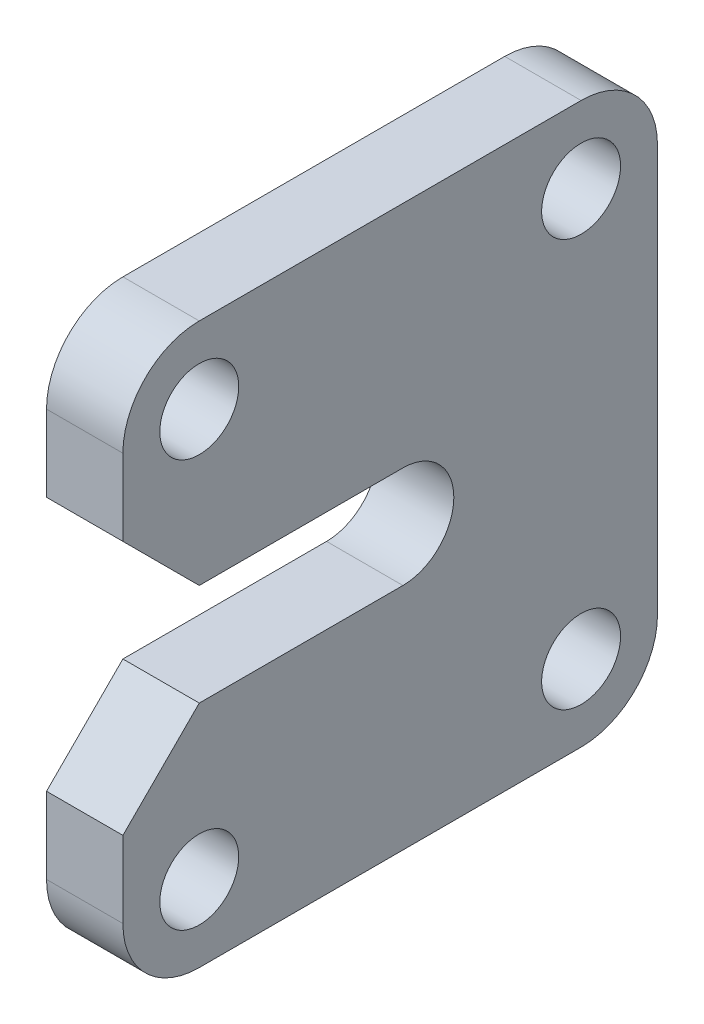
ISO-10303-21;
HEADER;
FILE_DESCRIPTION(('STEP AP214'),'2;1');
FILE_NAME('part.step','',(''),(''),'','','');
FILE_SCHEMA(('AUTOMOTIVE_DESIGN { 1 0 10303 214 1 1 1 1 }'));
ENDSEC;
DATA;
#1=APPLICATION_CONTEXT('core data for automotive mechanical design processes');
#2=APPLICATION_PROTOCOL_DEFINITION('international standard','automotive_design',2000,#1);
#3=PRODUCT_CONTEXT('',#1,'mechanical');
#4=PRODUCT('Part','Part','',(#3));
#5=PRODUCT_RELATED_PRODUCT_CATEGORY('part','',(#4));
#6=PRODUCT_DEFINITION_FORMATION('','',#4);
#7=PRODUCT_DEFINITION_CONTEXT('part definition',#1,'design');
#8=PRODUCT_DEFINITION('design','',#6,#7);
#9=PRODUCT_DEFINITION_SHAPE('','',#8);
#10=(LENGTH_UNIT() NAMED_UNIT(*) SI_UNIT(.MILLI.,.METRE.));
#11=(NAMED_UNIT(*) PLANE_ANGLE_UNIT() SI_UNIT($,.RADIAN.));
#12=(NAMED_UNIT(*) SI_UNIT($,.STERADIAN.) SOLID_ANGLE_UNIT());
#13=UNCERTAINTY_MEASURE_WITH_UNIT(LENGTH_MEASURE(1.E-05),#10,'distance_accuracy_value','');
#14=(GEOMETRIC_REPRESENTATION_CONTEXT(3) GLOBAL_UNCERTAINTY_ASSIGNED_CONTEXT((#13)) GLOBAL_UNIT_ASSIGNED_CONTEXT((#10,
#11,#12)) REPRESENTATION_CONTEXT('',''));
#15=CARTESIAN_POINT('',(0.,0.,0.));
#16=DIRECTION('',(0.,0.,1.));
#17=DIRECTION('',(1.,0.,0.));
#18=AXIS2_PLACEMENT_3D('',#15,#16,#17);
#19=CARTESIAN_POINT('',(1.5,0.,99.));
#20=DIRECTION('',(-1.,0.,0.));
#21=DIRECTION('',(0.,0.,1.));
#22=AXIS2_PLACEMENT_3D('',#19,#20,#21);
#23=PLANE('',#22);
#24=DIRECTION('',(0.,-1.,0.));
#25=VECTOR('',#24,1.);
#26=CARTESIAN_POINT('',(1.5,-5.,110.));
#27=LINE('',#26,#25);
#28=CARTESIAN_POINT('',(1.5,-5.,110.));
#29=VERTEX_POINT('',#28);
#30=CARTESIAN_POINT('',(1.5,-7.99999999999999,110.));
#31=VERTEX_POINT('',#30);
#32=EDGE_CURVE('E263',#29,#31,#27,.T.);
#33=ORIENTED_EDGE('',*,*,#32,.T.);
#34=CARTESIAN_POINT('',(1.5,-8.,107.));
#35=DIRECTION('',(-1.,0.,0.));
#36=DIRECTION('',(0.,0.,1.));
#37=AXIS2_PLACEMENT_3D('',#34,#35,#36);
#38=CIRCLE('',#37,3.);
#39=CARTESIAN_POINT('',(1.5,-11.,107.));
#40=VERTEX_POINT('',#39);
#41=EDGE_CURVE('E184',#31,#40,#38,.F.);
#42=ORIENTED_EDGE('',*,*,#41,.T.);
#43=DIRECTION('',(0.,0.,-1.));
#44=VECTOR('',#43,1.);
#45=CARTESIAN_POINT('',(1.5,-11.,89.));
#46=LINE('',#45,#44);
#47=CARTESIAN_POINT('',(1.5,-11.,92.));
#48=VERTEX_POINT('',#47);
#49=EDGE_CURVE('E257',#40,#48,#46,.T.);
#50=ORIENTED_EDGE('',*,*,#49,.T.);
#51=CARTESIAN_POINT('',(1.5,-8.,92.));
#52=DIRECTION('',(-1.,0.,0.));
#53=DIRECTION('',(0.,0.,1.));
#54=AXIS2_PLACEMENT_3D('',#51,#52,#53);
#55=CIRCLE('',#54,3.);
#56=CARTESIAN_POINT('',(1.5,-8.,89.));
#57=VERTEX_POINT('',#56);
#58=EDGE_CURVE('E182',#48,#57,#55,.F.);
#59=ORIENTED_EDGE('',*,*,#58,.T.);
#60=DIRECTION('',(0.,1.,0.));
#61=VECTOR('',#60,1.);
#62=CARTESIAN_POINT('',(1.5,11.,89.));
#63=LINE('',#62,#61);
#64=CARTESIAN_POINT('',(1.5,8.,89.));
#65=VERTEX_POINT('',#64);
#66=EDGE_CURVE('E256',#57,#65,#63,.T.);
#67=ORIENTED_EDGE('',*,*,#66,.T.);
#68=CARTESIAN_POINT('',(1.5,8.,92.));
#69=DIRECTION('',(-1.,0.,0.));
#70=DIRECTION('',(0.,0.,1.));
#71=AXIS2_PLACEMENT_3D('',#68,#69,#70);
#72=CIRCLE('',#71,3.);
#73=CARTESIAN_POINT('',(1.5,11.,92.));
#74=VERTEX_POINT('',#73);
#75=EDGE_CURVE('E180',#65,#74,#72,.F.);
#76=ORIENTED_EDGE('',*,*,#75,.T.);
#77=DIRECTION('',(0.,0.,1.));
#78=VECTOR('',#77,1.);
#79=CARTESIAN_POINT('',(1.5,11.,89.));
#80=LINE('',#79,#78);
#81=CARTESIAN_POINT('',(1.5,11.,107.));
#82=VERTEX_POINT('',#81);
#83=EDGE_CURVE('E196',#74,#82,#80,.T.);
#84=ORIENTED_EDGE('',*,*,#83,.T.);
#85=CARTESIAN_POINT('',(1.5,8.,107.));
#86=DIRECTION('',(-1.,0.,0.));
#87=DIRECTION('',(0.,0.,1.));
#88=AXIS2_PLACEMENT_3D('',#85,#86,#87);
#89=CIRCLE('',#88,3.);
#90=CARTESIAN_POINT('',(1.5,8.,110.));
#91=VERTEX_POINT('',#90);
#92=EDGE_CURVE('E47',#82,#91,#89,.F.);
#93=ORIENTED_EDGE('',*,*,#92,.T.);
#94=DIRECTION('',(0.,-1.,0.));
#95=VECTOR('',#94,1.);
#96=CARTESIAN_POINT('',(1.5,11.,110.));
#97=LINE('',#96,#95);
#98=CARTESIAN_POINT('',(1.5,4.99999999999999,110.));
#99=VERTEX_POINT('',#98);
#100=EDGE_CURVE('E150',#91,#99,#97,.T.);
#101=ORIENTED_EDGE('',*,*,#100,.T.);
#102=DIRECTION('',(0.,-0.707106781186546,-0.707106781186549));
#103=VECTOR('',#102,1.);
#104=CARTESIAN_POINT('',(1.5,4.99999999999999,110.));
#105=LINE('',#104,#103);
#106=CARTESIAN_POINT('',(1.5,2.,107.));
#107=VERTEX_POINT('',#106);
#108=EDGE_CURVE('E145',#99,#107,#105,.T.);
#109=ORIENTED_EDGE('',*,*,#108,.T.);
#110=DIRECTION('',(0.,0.,-1.));
#111=VECTOR('',#110,1.);
#112=CARTESIAN_POINT('',(1.5,2.,107.));
#113=LINE('',#112,#111);
#114=CARTESIAN_POINT('',(1.5,2.,99.));
#115=VERTEX_POINT('',#114);
#116=EDGE_CURVE('E135',#107,#115,#113,.T.);
#117=ORIENTED_EDGE('',*,*,#116,.T.);
#118=CARTESIAN_POINT('',(1.5,0.,99.));
#119=DIRECTION('',(-1.,0.,0.));
#120=DIRECTION('',(0.,0.,1.));
#121=AXIS2_PLACEMENT_3D('',#118,#119,#120);
#122=CIRCLE('',#121,2.);
#123=CARTESIAN_POINT('',(1.5,-2.,99.));
#124=VERTEX_POINT('',#123);
#125=EDGE_CURVE('E144',#115,#124,#122,.T.);
#126=ORIENTED_EDGE('',*,*,#125,.T.);
#127=DIRECTION('',(0.,0.,1.));
#128=VECTOR('',#127,1.);
#129=CARTESIAN_POINT('',(1.5,-2.,99.));
#130=LINE('',#129,#128);
#131=CARTESIAN_POINT('',(1.5,-2.,107.));
#132=VERTEX_POINT('',#131);
#133=EDGE_CURVE('E228',#124,#132,#130,.T.);
#134=ORIENTED_EDGE('',*,*,#133,.T.);
#135=DIRECTION('',(0.,-0.707106781186549,0.707106781186546));
#136=VECTOR('',#135,1.);
#137=CARTESIAN_POINT('',(1.5,-2.,107.));
#138=LINE('',#137,#136);
#139=EDGE_CURVE('E271',#132,#29,#138,.T.);
#140=ORIENTED_EDGE('',*,*,#139,.T.);
#141=EDGE_LOOP('',(#33,#42,#50,#59,#67,#76,#84,#93,#101,#109,#117,#126,#134,#140));
#142=FACE_BOUND('',#141,.T.);
#143=CARTESIAN_POINT('',(1.5,8.,107.));
#144=DIRECTION('',(1.,0.,0.));
#145=DIRECTION('',(0.,0.,-1.));
#146=AXIS2_PLACEMENT_3D('',#143,#144,#145);
#147=CIRCLE('',#146,1.54999999999999);
#148=CARTESIAN_POINT('',(1.5,8.,105.45));
#149=VERTEX_POINT('',#148);
#150=EDGE_CURVE('E268',#149,#149,#147,.T.);
#151=ORIENTED_EDGE('',*,*,#150,.F.);
#152=EDGE_LOOP('',(#151));
#153=FACE_BOUND('',#152,.T.);
#154=CARTESIAN_POINT('',(1.5,8.,92.));
#155=DIRECTION('',(1.,0.,0.));
#156=DIRECTION('',(0.,0.,-1.));
#157=AXIS2_PLACEMENT_3D('',#154,#155,#156);
#158=CIRCLE('',#157,1.55000000000001);
#159=CARTESIAN_POINT('',(1.5,8.,90.45));
#160=VERTEX_POINT('',#159);
#161=EDGE_CURVE('E475',#160,#160,#158,.T.);
#162=ORIENTED_EDGE('',*,*,#161,.F.);
#163=EDGE_LOOP('',(#162));
#164=FACE_BOUND('',#163,.T.);
#165=CARTESIAN_POINT('',(1.5,-8.,92.));
#166=DIRECTION('',(1.,0.,0.));
#167=DIRECTION('',(0.,0.,-1.));
#168=AXIS2_PLACEMENT_3D('',#165,#166,#167);
#169=CIRCLE('',#168,1.55000000000001);
#170=CARTESIAN_POINT('',(1.5,-8.,90.45));
#171=VERTEX_POINT('',#170);
#172=EDGE_CURVE('E469',#171,#171,#169,.T.);
#173=ORIENTED_EDGE('',*,*,#172,.F.);
#174=EDGE_LOOP('',(#173));
#175=FACE_BOUND('',#174,.T.);
#176=CARTESIAN_POINT('',(1.5,-8.,107.));
#177=DIRECTION('',(1.,0.,0.));
#178=DIRECTION('',(0.,0.,-1.));
#179=AXIS2_PLACEMENT_3D('',#176,#177,#178);
#180=CIRCLE('',#179,1.54999999999999);
#181=CARTESIAN_POINT('',(1.5,-8.,105.45));
#182=VERTEX_POINT('',#181);
#183=EDGE_CURVE('E460',#182,#182,#180,.T.);
#184=ORIENTED_EDGE('',*,*,#183,.F.);
#185=EDGE_LOOP('',(#184));
#186=FACE_BOUND('',#185,.T.);
#187=ADVANCED_FACE('F32',(#142,#153,#164,#175,#186),#23,.F.);
#188=CARTESIAN_POINT('',(-1.5,0.,99.));
#189=DIRECTION('',(-1.,0.,0.));
#190=DIRECTION('',(0.,0.,1.));
#191=AXIS2_PLACEMENT_3D('',#188,#189,#190);
#192=PLANE('',#191);
#193=CARTESIAN_POINT('',(-1.5,-8.,92.));
#194=DIRECTION('',(1.,0.,0.));
#195=DIRECTION('',(0.,0.,-1.));
#196=AXIS2_PLACEMENT_3D('',#193,#194,#195);
#197=CIRCLE('',#196,1.55000000000001);
#198=CARTESIAN_POINT('',(-1.5,-8.,90.45));
#199=VERTEX_POINT('',#198);
#200=EDGE_CURVE('E466',#199,#199,#197,.T.);
#201=ORIENTED_EDGE('',*,*,#200,.T.);
#202=EDGE_LOOP('',(#201));
#203=FACE_BOUND('',#202,.T.);
#204=CARTESIAN_POINT('',(-1.5,8.,107.));
#205=DIRECTION('',(1.,0.,0.));
#206=DIRECTION('',(0.,0.,-1.));
#207=AXIS2_PLACEMENT_3D('',#204,#205,#206);
#208=CIRCLE('',#207,1.54999999999999);
#209=CARTESIAN_POINT('',(-1.5,8.,105.45));
#210=VERTEX_POINT('',#209);
#211=EDGE_CURVE('E478',#210,#210,#208,.T.);
#212=ORIENTED_EDGE('',*,*,#211,.T.);
#213=EDGE_LOOP('',(#212));
#214=FACE_BOUND('',#213,.T.);
#215=DIRECTION('',(0.,0.,-1.));
#216=VECTOR('',#215,1.);
#217=CARTESIAN_POINT('',(-1.5,-11.,89.));
#218=LINE('',#217,#216);
#219=CARTESIAN_POINT('',(-1.5,-11.,107.));
#220=VERTEX_POINT('',#219);
#221=CARTESIAN_POINT('',(-1.5,-11.,92.));
#222=VERTEX_POINT('',#221);
#223=EDGE_CURVE('E209',#220,#222,#218,.T.);
#224=ORIENTED_EDGE('',*,*,#223,.F.);
#225=CARTESIAN_POINT('',(-1.5,-8.,107.));
#226=DIRECTION('',(-1.,0.,0.));
#227=DIRECTION('',(0.,0.,1.));
#228=AXIS2_PLACEMENT_3D('',#225,#226,#227);
#229=CIRCLE('',#228,3.);
#230=CARTESIAN_POINT('',(-1.5,-7.99999999999999,110.));
#231=VERTEX_POINT('',#230);
#232=EDGE_CURVE('E175',#220,#231,#229,.T.);
#233=ORIENTED_EDGE('',*,*,#232,.T.);
#234=DIRECTION('',(0.,-1.,0.));
#235=VECTOR('',#234,1.);
#236=CARTESIAN_POINT('',(-1.5,-5.,110.));
#237=LINE('',#236,#235);
#238=CARTESIAN_POINT('',(-1.5,-5.,110.));
#239=VERTEX_POINT('',#238);
#240=EDGE_CURVE('E236',#239,#231,#237,.T.);
#241=ORIENTED_EDGE('',*,*,#240,.F.);
#242=DIRECTION('',(0.,-0.707106781186549,0.707106781186546));
#243=VECTOR('',#242,1.);
#244=CARTESIAN_POINT('',(-1.5,-2.,107.));
#245=LINE('',#244,#243);
#246=CARTESIAN_POINT('',(-1.5,-2.,107.));
#247=VERTEX_POINT('',#246);
#248=EDGE_CURVE('E234',#247,#239,#245,.T.);
#249=ORIENTED_EDGE('',*,*,#248,.F.);
#250=DIRECTION('',(0.,0.,1.));
#251=VECTOR('',#250,1.);
#252=CARTESIAN_POINT('',(-1.5,-2.,99.));
#253=LINE('',#252,#251);
#254=CARTESIAN_POINT('',(-1.5,-2.,99.));
#255=VERTEX_POINT('',#254);
#256=EDGE_CURVE('E227',#255,#247,#253,.T.);
#257=ORIENTED_EDGE('',*,*,#256,.F.);
#258=CARTESIAN_POINT('',(-1.5,0.,99.));
#259=DIRECTION('',(-1.,0.,0.));
#260=DIRECTION('',(0.,0.,1.));
#261=AXIS2_PLACEMENT_3D('',#258,#259,#260);
#262=CIRCLE('',#261,2.);
#263=CARTESIAN_POINT('',(-1.5,2.,99.));
#264=VERTEX_POINT('',#263);
#265=EDGE_CURVE('E232',#264,#255,#262,.T.);
#266=ORIENTED_EDGE('',*,*,#265,.F.);
#267=DIRECTION('',(0.,0.,-1.));
#268=VECTOR('',#267,1.);
#269=CARTESIAN_POINT('',(-1.5,2.,107.));
#270=LINE('',#269,#268);
#271=CARTESIAN_POINT('',(-1.5,2.,107.));
#272=VERTEX_POINT('',#271);
#273=EDGE_CURVE('E238',#272,#264,#270,.T.);
#274=ORIENTED_EDGE('',*,*,#273,.F.);
#275=DIRECTION('',(0.,-0.707106781186546,-0.707106781186549));
#276=VECTOR('',#275,1.);
#277=CARTESIAN_POINT('',(-1.5,4.99999999999999,110.));
#278=LINE('',#277,#276);
#279=CARTESIAN_POINT('',(-1.5,4.99999999999999,110.));
#280=VERTEX_POINT('',#279);
#281=EDGE_CURVE('E158',#280,#272,#278,.T.);
#282=ORIENTED_EDGE('',*,*,#281,.F.);
#283=DIRECTION('',(0.,-1.,0.));
#284=VECTOR('',#283,1.);
#285=CARTESIAN_POINT('',(-1.5,11.,110.));
#286=LINE('',#285,#284);
#287=CARTESIAN_POINT('',(-1.5,8.,110.));
#288=VERTEX_POINT('',#287);
#289=EDGE_CURVE('E154',#288,#280,#286,.T.);
#290=ORIENTED_EDGE('',*,*,#289,.F.);
#291=CARTESIAN_POINT('',(-1.5,8.,107.));
#292=DIRECTION('',(-1.,0.,0.));
#293=DIRECTION('',(0.,0.,1.));
#294=AXIS2_PLACEMENT_3D('',#291,#292,#293);
#295=CIRCLE('',#294,3.);
#296=CARTESIAN_POINT('',(-1.5,11.,107.));
#297=VERTEX_POINT('',#296);
#298=EDGE_CURVE('E169',#288,#297,#295,.T.);
#299=ORIENTED_EDGE('',*,*,#298,.T.);
#300=DIRECTION('',(0.,0.,1.));
#301=VECTOR('',#300,1.);
#302=CARTESIAN_POINT('',(-1.5,11.,89.));
#303=LINE('',#302,#301);
#304=CARTESIAN_POINT('',(-1.5,11.,92.));
#305=VERTEX_POINT('',#304);
#306=EDGE_CURVE('E195',#305,#297,#303,.T.);
#307=ORIENTED_EDGE('',*,*,#306,.F.);
#308=CARTESIAN_POINT('',(-1.5,8.,92.));
#309=DIRECTION('',(-1.,0.,0.));
#310=DIRECTION('',(0.,0.,1.));
#311=AXIS2_PLACEMENT_3D('',#308,#309,#310);
#312=CIRCLE('',#311,3.);
#313=CARTESIAN_POINT('',(-1.5,8.,89.));
#314=VERTEX_POINT('',#313);
#315=EDGE_CURVE('E171',#305,#314,#312,.T.);
#316=ORIENTED_EDGE('',*,*,#315,.T.);
#317=DIRECTION('',(0.,1.,0.));
#318=VECTOR('',#317,1.);
#319=CARTESIAN_POINT('',(-1.5,11.,89.));
#320=LINE('',#319,#318);
#321=CARTESIAN_POINT('',(-1.5,-8.,89.));
#322=VERTEX_POINT('',#321);
#323=EDGE_CURVE('E206',#322,#314,#320,.T.);
#324=ORIENTED_EDGE('',*,*,#323,.F.);
#325=CARTESIAN_POINT('',(-1.5,-8.,92.));
#326=DIRECTION('',(-1.,0.,0.));
#327=DIRECTION('',(0.,0.,1.));
#328=AXIS2_PLACEMENT_3D('',#325,#326,#327);
#329=CIRCLE('',#328,3.);
#330=EDGE_CURVE('E173',#322,#222,#329,.T.);
#331=ORIENTED_EDGE('',*,*,#330,.T.);
#332=EDGE_LOOP('',(#224,#233,#241,#249,#257,#266,#274,#282,#290,#299,#307,#316,#324,#331));
#333=FACE_BOUND('',#332,.T.);
#334=CARTESIAN_POINT('',(-1.5,8.,92.));
#335=DIRECTION('',(1.,0.,0.));
#336=DIRECTION('',(0.,0.,-1.));
#337=AXIS2_PLACEMENT_3D('',#334,#335,#336);
#338=CIRCLE('',#337,1.55000000000001);
#339=CARTESIAN_POINT('',(-1.5,8.,90.45));
#340=VERTEX_POINT('',#339);
#341=EDGE_CURVE('E472',#340,#340,#338,.T.);
#342=ORIENTED_EDGE('',*,*,#341,.T.);
#343=EDGE_LOOP('',(#342));
#344=FACE_BOUND('',#343,.T.);
#345=CARTESIAN_POINT('',(-1.5,-8.,107.));
#346=DIRECTION('',(1.,0.,0.));
#347=DIRECTION('',(0.,0.,-1.));
#348=AXIS2_PLACEMENT_3D('',#345,#346,#347);
#349=CIRCLE('',#348,1.54999999999999);
#350=CARTESIAN_POINT('',(-1.5,-8.,105.45));
#351=VERTEX_POINT('',#350);
#352=EDGE_CURVE('E463',#351,#351,#349,.T.);
#353=ORIENTED_EDGE('',*,*,#352,.T.);
#354=EDGE_LOOP('',(#353));
#355=FACE_BOUND('',#354,.T.);
#356=ADVANCED_FACE('F201',(#203,#214,#333,#344,#355),#192,.T.);
#357=CARTESIAN_POINT('',(1.5,4.99999999999999,110.));
#358=DIRECTION('',(0.,0.707106781186549,-0.707106781186546));
#359=DIRECTION('',(0.,0.707106781186546,0.707106781186549));
#360=AXIS2_PLACEMENT_3D('',#357,#358,#359);
#361=PLANE('',#360);
#362=ORIENTED_EDGE('',*,*,#281,.T.);
#363=DIRECTION('',(-1.,0.,0.));
#364=VECTOR('',#363,1.);
#365=CARTESIAN_POINT('',(1.5,2.,107.));
#366=LINE('',#365,#364);
#367=EDGE_CURVE('E139',#107,#272,#366,.T.);
#368=ORIENTED_EDGE('',*,*,#367,.F.);
#369=ORIENTED_EDGE('',*,*,#108,.F.);
#370=DIRECTION('',(-1.,0.,0.));
#371=VECTOR('',#370,1.);
#372=CARTESIAN_POINT('',(1.5,4.99999999999999,110.));
#373=LINE('',#372,#371);
#374=EDGE_CURVE('E213',#99,#280,#373,.T.);
#375=ORIENTED_EDGE('',*,*,#374,.T.);
#376=EDGE_LOOP('',(#362,#368,#369,#375));
#377=FACE_BOUND('',#376,.T.);
#378=ADVANCED_FACE('F156',(#377),#361,.F.);
#379=CARTESIAN_POINT('',(1.5,2.,107.));
#380=DIRECTION('',(0.,1.,0.));
#381=DIRECTION('',(0.,0.,1.));
#382=AXIS2_PLACEMENT_3D('',#379,#380,#381);
#383=PLANE('',#382);
#384=ORIENTED_EDGE('',*,*,#273,.T.);
#385=DIRECTION('',(-1.,0.,0.));
#386=VECTOR('',#385,1.);
#387=CARTESIAN_POINT('',(1.5,2.,99.));
#388=LINE('',#387,#386);
#389=EDGE_CURVE('E142',#115,#264,#388,.T.);
#390=ORIENTED_EDGE('',*,*,#389,.F.);
#391=ORIENTED_EDGE('',*,*,#116,.F.);
#392=ORIENTED_EDGE('',*,*,#367,.T.);
#393=EDGE_LOOP('',(#384,#390,#391,#392));
#394=FACE_BOUND('',#393,.T.);
#395=ADVANCED_FACE('F137',(#394),#383,.F.);
#396=CARTESIAN_POINT('',(1.5,0.,99.));
#397=DIRECTION('',(-1.,0.,0.));
#398=DIRECTION('',(0.,0.,1.));
#399=AXIS2_PLACEMENT_3D('',#396,#397,#398);
#400=CYLINDRICAL_SURFACE('',#399,2.);
#401=ORIENTED_EDGE('',*,*,#265,.T.);
#402=DIRECTION('',(-1.,0.,0.));
#403=VECTOR('',#402,1.);
#404=CARTESIAN_POINT('',(1.5,-2.,99.));
#405=LINE('',#404,#403);
#406=EDGE_CURVE('E163',#124,#255,#405,.T.);
#407=ORIENTED_EDGE('',*,*,#406,.F.);
#408=ORIENTED_EDGE('',*,*,#125,.F.);
#409=ORIENTED_EDGE('',*,*,#389,.T.);
#410=EDGE_LOOP('',(#401,#407,#408,#409));
#411=FACE_BOUND('',#410,.T.);
#412=ADVANCED_FACE('F269',(#411),#400,.F.);
#413=CARTESIAN_POINT('',(1.5,-2.,99.));
#414=DIRECTION('',(0.,-1.,0.));
#415=DIRECTION('',(0.,0.,-1.));
#416=AXIS2_PLACEMENT_3D('',#413,#414,#415);
#417=PLANE('',#416);
#418=ORIENTED_EDGE('',*,*,#256,.T.);
#419=DIRECTION('',(-1.,0.,0.));
#420=VECTOR('',#419,1.);
#421=CARTESIAN_POINT('',(1.5,-2.,107.));
#422=LINE('',#421,#420);
#423=EDGE_CURVE('E218',#132,#247,#422,.T.);
#424=ORIENTED_EDGE('',*,*,#423,.F.);
#425=ORIENTED_EDGE('',*,*,#133,.F.);
#426=ORIENTED_EDGE('',*,*,#406,.T.);
#427=EDGE_LOOP('',(#418,#424,#425,#426));
#428=FACE_BOUND('',#427,.T.);
#429=ADVANCED_FACE('F225',(#428),#417,.F.);
#430=CARTESIAN_POINT('',(1.5,-2.,107.));
#431=DIRECTION('',(0.,-0.707106781186546,-0.707106781186549));
#432=DIRECTION('',(0.,0.707106781186549,-0.707106781186546));
#433=AXIS2_PLACEMENT_3D('',#430,#431,#432);
#434=PLANE('',#433);
#435=ORIENTED_EDGE('',*,*,#248,.T.);
#436=DIRECTION('',(-1.,0.,0.));
#437=VECTOR('',#436,1.);
#438=CARTESIAN_POINT('',(1.5,-5.,110.));
#439=LINE('',#438,#437);
#440=EDGE_CURVE('E215',#29,#239,#439,.T.);
#441=ORIENTED_EDGE('',*,*,#440,.F.);
#442=ORIENTED_EDGE('',*,*,#139,.F.);
#443=ORIENTED_EDGE('',*,*,#423,.T.);
#444=EDGE_LOOP('',(#435,#441,#442,#443));
#445=FACE_BOUND('',#444,.T.);
#446=ADVANCED_FACE('F284',(#445),#434,.F.);
#447=CARTESIAN_POINT('',(1.5,-5.,110.));
#448=DIRECTION('',(0.,0.,-1.));
#449=DIRECTION('',(0.,1.,0.));
#450=AXIS2_PLACEMENT_3D('',#447,#448,#449);
#451=PLANE('',#450);
#452=ORIENTED_EDGE('',*,*,#240,.T.);
#453=DIRECTION('',(-1.,0.,0.));
#454=VECTOR('',#453,1.);
#455=CARTESIAN_POINT('',(1.5,-7.99999999999999,110.));
#456=LINE('',#455,#454);
#457=EDGE_CURVE('E177',#231,#31,#456,.F.);
#458=ORIENTED_EDGE('',*,*,#457,.T.);
#459=ORIENTED_EDGE('',*,*,#32,.F.);
#460=ORIENTED_EDGE('',*,*,#440,.T.);
#461=EDGE_LOOP('',(#452,#458,#459,#460));
#462=FACE_BOUND('',#461,.T.);
#463=ADVANCED_FACE('F282',(#462),#451,.F.);
#464=CARTESIAN_POINT('',(1.5,-11.,89.));
#465=DIRECTION('',(0.,1.,0.));
#466=DIRECTION('',(0.,0.,1.));
#467=AXIS2_PLACEMENT_3D('',#464,#465,#466);
#468=PLANE('',#467);
#469=ORIENTED_EDGE('',*,*,#49,.F.);
#470=DIRECTION('',(-1.,0.,0.));
#471=VECTOR('',#470,1.);
#472=CARTESIAN_POINT('',(1.5,-11.,107.));
#473=LINE('',#472,#471);
#474=EDGE_CURVE('E161',#40,#220,#473,.T.);
#475=ORIENTED_EDGE('',*,*,#474,.T.);
#476=ORIENTED_EDGE('',*,*,#223,.T.);
#477=DIRECTION('',(-1.,0.,0.));
#478=VECTOR('',#477,1.);
#479=CARTESIAN_POINT('',(1.5,-11.,92.));
#480=LINE('',#479,#478);
#481=EDGE_CURVE('E159',#222,#48,#480,.F.);
#482=ORIENTED_EDGE('',*,*,#481,.T.);
#483=EDGE_LOOP('',(#469,#475,#476,#482));
#484=FACE_BOUND('',#483,.T.);
#485=ADVANCED_FACE('F247',(#484),#468,.F.);
#486=CARTESIAN_POINT('',(1.5,11.,89.));
#487=DIRECTION('',(0.,0.,1.));
#488=DIRECTION('',(1.,0.,0.));
#489=AXIS2_PLACEMENT_3D('',#486,#487,#488);
#490=PLANE('',#489);
#491=ORIENTED_EDGE('',*,*,#66,.F.);
#492=DIRECTION('',(-1.,0.,0.));
#493=VECTOR('',#492,1.);
#494=CARTESIAN_POINT('',(1.5,-8.,89.));
#495=LINE('',#494,#493);
#496=EDGE_CURVE('E188',#57,#322,#495,.T.);
#497=ORIENTED_EDGE('',*,*,#496,.T.);
#498=ORIENTED_EDGE('',*,*,#323,.T.);
#499=DIRECTION('',(-1.,0.,0.));
#500=VECTOR('',#499,1.);
#501=CARTESIAN_POINT('',(1.5,8.,89.));
#502=LINE('',#501,#500);
#503=EDGE_CURVE('E186',#314,#65,#502,.F.);
#504=ORIENTED_EDGE('',*,*,#503,.T.);
#505=EDGE_LOOP('',(#491,#497,#498,#504));
#506=FACE_BOUND('',#505,.T.);
#507=ADVANCED_FACE('F259',(#506),#490,.F.);
#508=CARTESIAN_POINT('',(1.5,11.,89.));
#509=DIRECTION('',(0.,-1.,0.));
#510=DIRECTION('',(0.,0.,-1.));
#511=AXIS2_PLACEMENT_3D('',#508,#509,#510);
#512=PLANE('',#511);
#513=ORIENTED_EDGE('',*,*,#83,.F.);
#514=DIRECTION('',(-1.,0.,0.));
#515=VECTOR('',#514,1.);
#516=CARTESIAN_POINT('',(1.5,11.,92.));
#517=LINE('',#516,#515);
#518=EDGE_CURVE('E40',#74,#305,#517,.T.);
#519=ORIENTED_EDGE('',*,*,#518,.T.);
#520=ORIENTED_EDGE('',*,*,#306,.T.);
#521=DIRECTION('',(-1.,0.,0.));
#522=VECTOR('',#521,1.);
#523=CARTESIAN_POINT('',(1.5,11.,107.));
#524=LINE('',#523,#522);
#525=EDGE_CURVE('E55',#297,#82,#524,.F.);
#526=ORIENTED_EDGE('',*,*,#525,.T.);
#527=EDGE_LOOP('',(#513,#519,#520,#526));
#528=FACE_BOUND('',#527,.T.);
#529=ADVANCED_FACE('F194',(#528),#512,.F.);
#530=CARTESIAN_POINT('',(1.5,11.,110.));
#531=DIRECTION('',(0.,0.,-1.));
#532=DIRECTION('',(-1.,0.,0.));
#533=AXIS2_PLACEMENT_3D('',#530,#531,#532);
#534=PLANE('',#533);
#535=ORIENTED_EDGE('',*,*,#100,.F.);
#536=DIRECTION('',(-1.,0.,0.));
#537=VECTOR('',#536,1.);
#538=CARTESIAN_POINT('',(1.5,8.,110.));
#539=LINE('',#538,#537);
#540=EDGE_CURVE('E11',#91,#288,#539,.T.);
#541=ORIENTED_EDGE('',*,*,#540,.T.);
#542=ORIENTED_EDGE('',*,*,#289,.T.);
#543=ORIENTED_EDGE('',*,*,#374,.F.);
#544=EDGE_LOOP('',(#535,#541,#542,#543));
#545=FACE_BOUND('',#544,.T.);
#546=ADVANCED_FACE('F304',(#545),#534,.F.);
#547=CARTESIAN_POINT('',(1.5,8.,107.));
#548=DIRECTION('',(-1.,0.,0.));
#549=DIRECTION('',(0.,0.,1.));
#550=AXIS2_PLACEMENT_3D('',#547,#548,#549);
#551=CYLINDRICAL_SURFACE('',#550,1.54999999999999);
#552=ORIENTED_EDGE('',*,*,#150,.T.);
#553=EDGE_LOOP('',(#552));
#554=FACE_BOUND('',#553,.T.);
#555=ORIENTED_EDGE('',*,*,#211,.F.);
#556=EDGE_LOOP('',(#555));
#557=FACE_BOUND('',#556,.T.);
#558=ADVANCED_FACE('F301',(#554,#557),#551,.F.);
#559=CARTESIAN_POINT('',(1.5,8.,92.));
#560=DIRECTION('',(-1.,0.,0.));
#561=DIRECTION('',(0.,0.,1.));
#562=AXIS2_PLACEMENT_3D('',#559,#560,#561);
#563=CYLINDRICAL_SURFACE('',#562,1.55000000000001);
#564=ORIENTED_EDGE('',*,*,#161,.T.);
#565=EDGE_LOOP('',(#564));
#566=FACE_BOUND('',#565,.T.);
#567=ORIENTED_EDGE('',*,*,#341,.F.);
#568=EDGE_LOOP('',(#567));
#569=FACE_BOUND('',#568,.T.);
#570=ADVANCED_FACE('F336',(#566,#569),#563,.F.);
#571=CARTESIAN_POINT('',(1.5,-8.,92.));
#572=DIRECTION('',(-1.,0.,0.));
#573=DIRECTION('',(0.,0.,1.));
#574=AXIS2_PLACEMENT_3D('',#571,#572,#573);
#575=CYLINDRICAL_SURFACE('',#574,1.55000000000001);
#576=ORIENTED_EDGE('',*,*,#172,.T.);
#577=EDGE_LOOP('',(#576));
#578=FACE_BOUND('',#577,.T.);
#579=ORIENTED_EDGE('',*,*,#200,.F.);
#580=EDGE_LOOP('',(#579));
#581=FACE_BOUND('',#580,.T.);
#582=ADVANCED_FACE('F343',(#578,#581),#575,.F.);
#583=CARTESIAN_POINT('',(1.5,-8.,107.));
#584=DIRECTION('',(-1.,0.,0.));
#585=DIRECTION('',(0.,0.,1.));
#586=AXIS2_PLACEMENT_3D('',#583,#584,#585);
#587=CYLINDRICAL_SURFACE('',#586,1.54999999999999);
#588=ORIENTED_EDGE('',*,*,#183,.T.);
#589=EDGE_LOOP('',(#588));
#590=FACE_BOUND('',#589,.T.);
#591=ORIENTED_EDGE('',*,*,#352,.F.);
#592=EDGE_LOOP('',(#591));
#593=FACE_BOUND('',#592,.T.);
#594=ADVANCED_FACE('F350',(#590,#593),#587,.F.);
#595=CARTESIAN_POINT('',(1.5,-8.,107.));
#596=DIRECTION('',(-1.,0.,0.));
#597=DIRECTION('',(0.,0.,1.));
#598=AXIS2_PLACEMENT_3D('',#595,#596,#597);
#599=CYLINDRICAL_SURFACE('',#598,3.);
#600=ORIENTED_EDGE('',*,*,#41,.F.);
#601=ORIENTED_EDGE('',*,*,#457,.F.);
#602=ORIENTED_EDGE('',*,*,#232,.F.);
#603=ORIENTED_EDGE('',*,*,#474,.F.);
#604=EDGE_LOOP('',(#600,#601,#602,#603));
#605=FACE_BOUND('',#604,.T.);
#606=ADVANCED_FACE('F281',(#605),#599,.T.);
#607=CARTESIAN_POINT('',(1.5,-8.,92.));
#608=DIRECTION('',(-1.,0.,0.));
#609=DIRECTION('',(0.,0.,1.));
#610=AXIS2_PLACEMENT_3D('',#607,#608,#609);
#611=CYLINDRICAL_SURFACE('',#610,3.);
#612=ORIENTED_EDGE('',*,*,#58,.F.);
#613=ORIENTED_EDGE('',*,*,#481,.F.);
#614=ORIENTED_EDGE('',*,*,#330,.F.);
#615=ORIENTED_EDGE('',*,*,#496,.F.);
#616=EDGE_LOOP('',(#612,#613,#614,#615));
#617=FACE_BOUND('',#616,.T.);
#618=ADVANCED_FACE('F252',(#617),#611,.T.);
#619=CARTESIAN_POINT('',(1.5,8.,92.));
#620=DIRECTION('',(-1.,0.,0.));
#621=DIRECTION('',(0.,0.,1.));
#622=AXIS2_PLACEMENT_3D('',#619,#620,#621);
#623=CYLINDRICAL_SURFACE('',#622,3.);
#624=ORIENTED_EDGE('',*,*,#75,.F.);
#625=ORIENTED_EDGE('',*,*,#503,.F.);
#626=ORIENTED_EDGE('',*,*,#315,.F.);
#627=ORIENTED_EDGE('',*,*,#518,.F.);
#628=EDGE_LOOP('',(#624,#625,#626,#627));
#629=FACE_BOUND('',#628,.T.);
#630=ADVANCED_FACE('F370',(#629),#623,.T.);
#631=CARTESIAN_POINT('',(1.5,8.,107.));
#632=DIRECTION('',(-1.,0.,0.));
#633=DIRECTION('',(0.,0.,1.));
#634=AXIS2_PLACEMENT_3D('',#631,#632,#633);
#635=CYLINDRICAL_SURFACE('',#634,3.);
#636=ORIENTED_EDGE('',*,*,#92,.F.);
#637=ORIENTED_EDGE('',*,*,#525,.F.);
#638=ORIENTED_EDGE('',*,*,#298,.F.);
#639=ORIENTED_EDGE('',*,*,#540,.F.);
#640=EDGE_LOOP('',(#636,#637,#638,#639));
#641=FACE_BOUND('',#640,.T.);
#642=ADVANCED_FACE('F34',(#641),#635,.T.);
#643=CLOSED_SHELL('',(#187,#356,#378,#395,#412,#429,#446,#463,#485,#507,#529,#546,#558,#570,
#582,#594,#606,#618,#630,#642));
#644=MANIFOLD_SOLID_BREP('B2',#643);
#645=ADVANCED_BREP_SHAPE_REPRESENTATION('',(#18,#644),#14);
#646=SHAPE_DEFINITION_REPRESENTATION(#9,#645);
ENDSEC;
END-ISO-10303-21;
